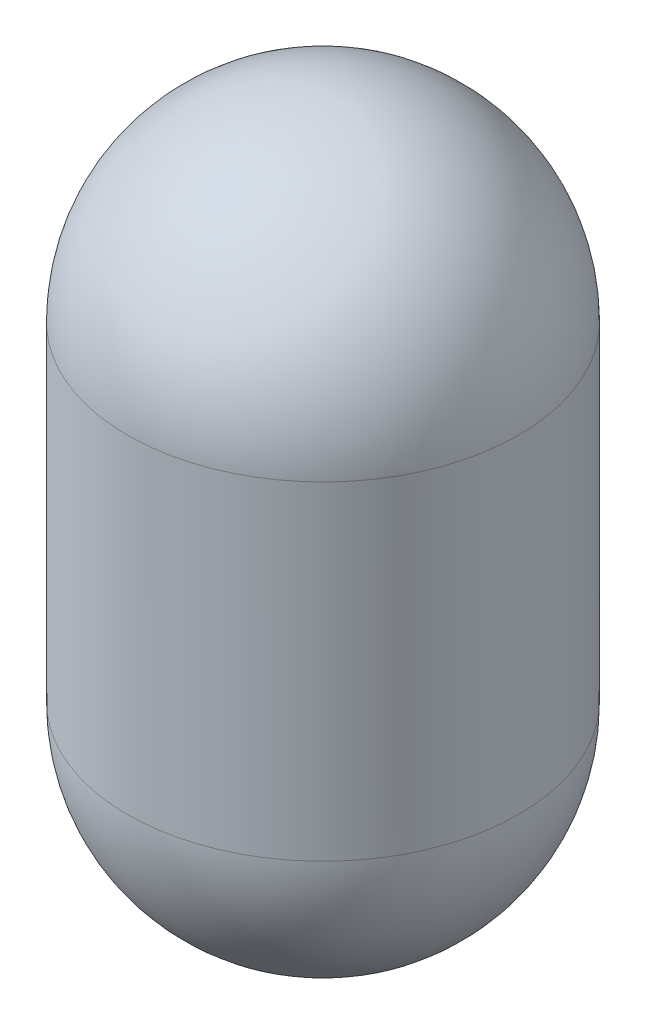
ISO-10303-21;
HEADER;
FILE_DESCRIPTION(('STEP AP214'),'2;1');
FILE_NAME('part.step','',(''),(''),'','','');
FILE_SCHEMA(('AUTOMOTIVE_DESIGN { 1 0 10303 214 1 1 1 1 }'));
ENDSEC;
DATA;
#1=APPLICATION_CONTEXT('core data for automotive mechanical design processes');
#2=APPLICATION_PROTOCOL_DEFINITION('international standard','automotive_design',2000,#1);
#3=PRODUCT_CONTEXT('',#1,'mechanical');
#4=PRODUCT('Part','Part','',(#3));
#5=PRODUCT_RELATED_PRODUCT_CATEGORY('part','',(#4));
#6=PRODUCT_DEFINITION_FORMATION('','',#4);
#7=PRODUCT_DEFINITION_CONTEXT('part definition',#1,'design');
#8=PRODUCT_DEFINITION('design','',#6,#7);
#9=PRODUCT_DEFINITION_SHAPE('','',#8);
#10=(LENGTH_UNIT() NAMED_UNIT(*) SI_UNIT(.MILLI.,.METRE.));
#11=(NAMED_UNIT(*) PLANE_ANGLE_UNIT() SI_UNIT($,.RADIAN.));
#12=(NAMED_UNIT(*) SI_UNIT($,.STERADIAN.) SOLID_ANGLE_UNIT());
#13=UNCERTAINTY_MEASURE_WITH_UNIT(LENGTH_MEASURE(1.E-05),#10,'distance_accuracy_value','');
#14=(GEOMETRIC_REPRESENTATION_CONTEXT(3) GLOBAL_UNCERTAINTY_ASSIGNED_CONTEXT((#13)) GLOBAL_UNIT_ASSIGNED_CONTEXT((#10,
#11,#12)) REPRESENTATION_CONTEXT('',''));
#15=CARTESIAN_POINT('',(0.,0.,0.));
#16=DIRECTION('',(0.,0.,1.));
#17=DIRECTION('',(1.,0.,0.));
#18=AXIS2_PLACEMENT_3D('',#15,#16,#17);
#19=CARTESIAN_POINT('',(0.,-158.75,0.));
#20=DIRECTION('',(0.,-1.,0.));
#21=DIRECTION('',(1.,0.,0.));
#22=AXIS2_PLACEMENT_3D('',#19,#20,#21);
#23=SPHERICAL_SURFACE('',#22,158.75);
#24=CARTESIAN_POINT('',(0.,-158.75,0.));
#25=DIRECTION('',(0.,-1.,0.));
#26=DIRECTION('',(0.,0.,-1.));
#27=AXIS2_PLACEMENT_3D('',#24,#25,#26);
#28=CIRCLE('',#27,158.75);
#29=CARTESIAN_POINT('',(0.,-158.75,-158.75));
#30=VERTEX_POINT('',#29);
#31=EDGE_CURVE('E10',#30,#30,#28,.T.);
#32=ORIENTED_EDGE('',*,*,#31,.F.);
#33=EDGE_LOOP('',(#32));
#34=FACE_BOUND('',#33,.T.);
#35=ADVANCED_FACE('F39',(#34),#23,.T.);
#36=CARTESIAN_POINT('',(0.,-584.2,0.));
#37=DIRECTION('',(0.,-1.,0.));
#38=DIRECTION('',(0.,0.,-1.));
#39=AXIS2_PLACEMENT_3D('',#36,#37,#38);
#40=CYLINDRICAL_SURFACE('',#39,158.75);
#41=CARTESIAN_POINT('',(0.,-425.45,0.));
#42=DIRECTION('',(0.,-1.,0.));
#43=DIRECTION('',(0.,0.,-1.));
#44=AXIS2_PLACEMENT_3D('',#41,#42,#43);
#45=CIRCLE('',#44,158.75);
#46=CARTESIAN_POINT('',(0.,-425.45,-158.75));
#47=VERTEX_POINT('',#46);
#48=EDGE_CURVE('E46',#47,#47,#45,.T.);
#49=ORIENTED_EDGE('',*,*,#48,.F.);
#50=EDGE_LOOP('',(#49));
#51=FACE_BOUND('',#50,.T.);
#52=ORIENTED_EDGE('',*,*,#31,.T.);
#53=EDGE_LOOP('',(#52));
#54=FACE_BOUND('',#53,.T.);
#55=ADVANCED_FACE('F55',(#51,#54),#40,.T.);
#56=CARTESIAN_POINT('',(0.,-425.45,0.));
#57=DIRECTION('',(0.,-1.,0.));
#58=DIRECTION('',(-1.,0.,0.));
#59=AXIS2_PLACEMENT_3D('',#56,#57,#58);
#60=SPHERICAL_SURFACE('',#59,158.75);
#61=ORIENTED_EDGE('',*,*,#48,.T.);
#62=EDGE_LOOP('',(#61));
#63=FACE_BOUND('',#62,.T.);
#64=ADVANCED_FACE('F53',(#63),#60,.T.);
#65=CLOSED_SHELL('',(#35,#55,#64));
#66=MANIFOLD_SOLID_BREP('B2',#65);
#67=ADVANCED_BREP_SHAPE_REPRESENTATION('',(#18,#66),#14);
#68=SHAPE_DEFINITION_REPRESENTATION(#9,#67);
ENDSEC;
END-ISO-10303-21;
